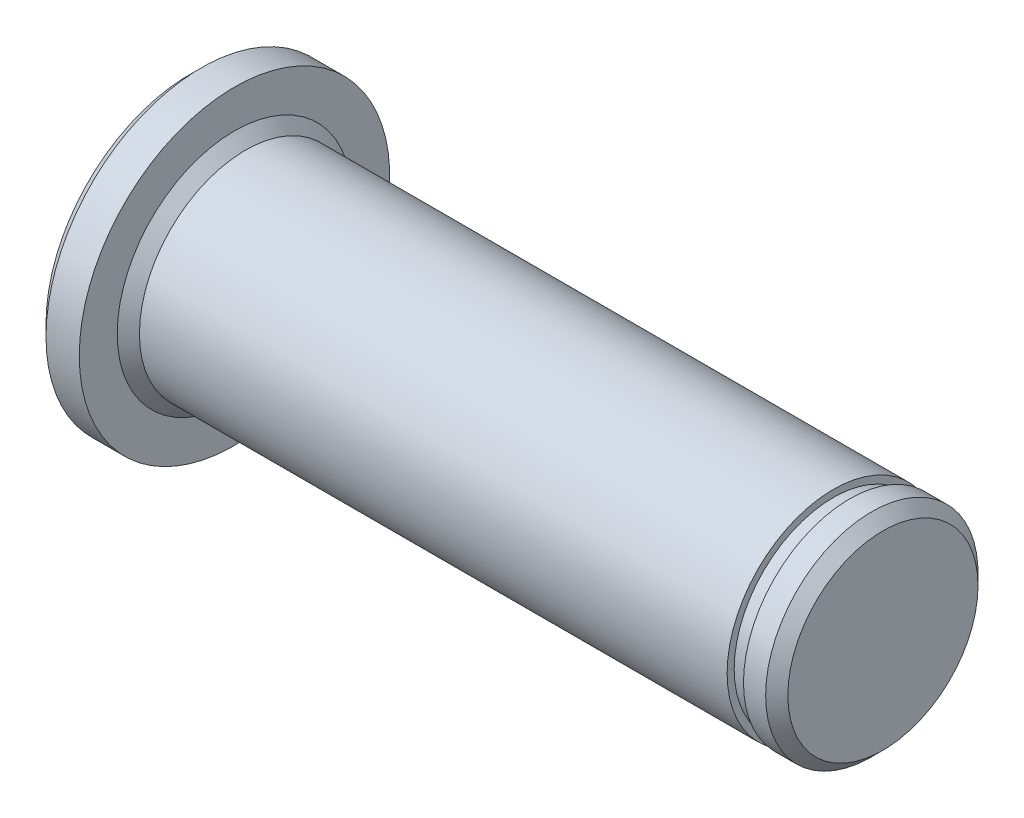
ISO-10303-21;
HEADER;
FILE_DESCRIPTION(('STEP AP214'),'2;1');
FILE_NAME('part.step','',(''),(''),'','','');
FILE_SCHEMA(('AUTOMOTIVE_DESIGN { 1 0 10303 214 1 1 1 1 }'));
ENDSEC;
DATA;
#1=APPLICATION_CONTEXT('core data for automotive mechanical design processes');
#2=APPLICATION_PROTOCOL_DEFINITION('international standard','automotive_design',2000,#1);
#3=PRODUCT_CONTEXT('',#1,'mechanical');
#4=PRODUCT('Part','Part','',(#3));
#5=PRODUCT_RELATED_PRODUCT_CATEGORY('part','',(#4));
#6=PRODUCT_DEFINITION_FORMATION('','',#4);
#7=PRODUCT_DEFINITION_CONTEXT('part definition',#1,'design');
#8=PRODUCT_DEFINITION('design','',#6,#7);
#9=PRODUCT_DEFINITION_SHAPE('','',#8);
#10=(LENGTH_UNIT() NAMED_UNIT(*) SI_UNIT(.MILLI.,.METRE.));
#11=(NAMED_UNIT(*) PLANE_ANGLE_UNIT() SI_UNIT($,.RADIAN.));
#12=(NAMED_UNIT(*) SI_UNIT($,.STERADIAN.) SOLID_ANGLE_UNIT());
#13=UNCERTAINTY_MEASURE_WITH_UNIT(LENGTH_MEASURE(1.E-05),#10,'distance_accuracy_value','');
#14=(GEOMETRIC_REPRESENTATION_CONTEXT(3) GLOBAL_UNCERTAINTY_ASSIGNED_CONTEXT((#13)) GLOBAL_UNIT_ASSIGNED_CONTEXT((#10,
#11,#12)) REPRESENTATION_CONTEXT('',''));
#15=CARTESIAN_POINT('',(0.,0.,0.));
#16=DIRECTION('',(0.,0.,1.));
#17=DIRECTION('',(1.,0.,0.));
#18=AXIS2_PLACEMENT_3D('',#15,#16,#17);
#19=CARTESIAN_POINT('',(-78.5354132953269,0.,0.));
#20=DIRECTION('',(-1.,0.,0.));
#21=DIRECTION('',(0.,0.,1.));
#22=AXIS2_PLACEMENT_3D('',#19,#20,#21);
#23=CYLINDRICAL_SURFACE('',#22,4.7875);
#24=CARTESIAN_POINT('',(0.5,0.,0.));
#25=DIRECTION('',(-1.,0.,0.));
#26=DIRECTION('',(0.,0.,1.));
#27=AXIS2_PLACEMENT_3D('',#24,#25,#26);
#28=CIRCLE('',#27,4.7875);
#29=CARTESIAN_POINT('',(0.5,0.,4.7875));
#30=VERTEX_POINT('',#29);
#31=EDGE_CURVE('E43',#30,#30,#28,.F.);
#32=ORIENTED_EDGE('',*,*,#31,.T.);
#33=EDGE_LOOP('',(#32));
#34=FACE_BOUND('',#33,.T.);
#35=CARTESIAN_POINT('',(27.,0.,0.));
#36=DIRECTION('',(-1.,0.,0.));
#37=DIRECTION('',(0.,0.,1.));
#38=AXIS2_PLACEMENT_3D('',#35,#36,#37);
#39=CIRCLE('',#38,4.7875);
#40=CARTESIAN_POINT('',(27.,0.,4.7875));
#41=VERTEX_POINT('',#40);
#42=EDGE_CURVE('E58',#41,#41,#39,.T.);
#43=ORIENTED_EDGE('',*,*,#42,.T.);
#44=EDGE_LOOP('',(#43));
#45=FACE_BOUND('',#44,.T.);
#46=ADVANCED_FACE('F32',(#34,#45),#23,.T.);
#47=CARTESIAN_POINT('',(27.,4.7875,0.));
#48=DIRECTION('',(-1.,0.,0.));
#49=DIRECTION('',(0.,0.,1.));
#50=AXIS2_PLACEMENT_3D('',#47,#48,#49);
#51=PLANE('',#50);
#52=ORIENTED_EDGE('',*,*,#42,.F.);
#53=EDGE_LOOP('',(#52));
#54=FACE_BOUND('',#53,.T.);
#55=CARTESIAN_POINT('',(27.,0.,0.));
#56=DIRECTION('',(-1.,0.,0.));
#57=DIRECTION('',(0.,0.,1.));
#58=AXIS2_PLACEMENT_3D('',#55,#56,#57);
#59=CIRCLE('',#58,4.47);
#60=CARTESIAN_POINT('',(27.,0.,4.47));
#61=VERTEX_POINT('',#60);
#62=EDGE_CURVE('E61',#61,#61,#59,.T.);
#63=ORIENTED_EDGE('',*,*,#62,.T.);
#64=EDGE_LOOP('',(#63));
#65=FACE_BOUND('',#64,.T.);
#66=ADVANCED_FACE('F92',(#54,#65),#51,.F.);
#67=CARTESIAN_POINT('',(-78.5354132953269,0.,0.));
#68=DIRECTION('',(-1.,0.,0.));
#69=DIRECTION('',(0.,0.,1.));
#70=AXIS2_PLACEMENT_3D('',#67,#68,#69);
#71=CYLINDRICAL_SURFACE('',#70,4.47);
#72=ORIENTED_EDGE('',*,*,#62,.F.);
#73=EDGE_LOOP('',(#72));
#74=FACE_BOUND('',#73,.T.);
#75=CARTESIAN_POINT('',(27.737,0.,0.));
#76=DIRECTION('',(-1.,0.,0.));
#77=DIRECTION('',(0.,0.,1.));
#78=AXIS2_PLACEMENT_3D('',#75,#76,#77);
#79=CIRCLE('',#78,4.47);
#80=CARTESIAN_POINT('',(27.737,0.,4.47));
#81=VERTEX_POINT('',#80);
#82=EDGE_CURVE('E64',#81,#81,#79,.T.);
#83=ORIENTED_EDGE('',*,*,#82,.T.);
#84=EDGE_LOOP('',(#83));
#85=FACE_BOUND('',#84,.T.);
#86=ADVANCED_FACE('F98',(#74,#85),#71,.T.);
#87=CARTESIAN_POINT('',(27.737,4.47,0.));
#88=DIRECTION('',(1.,0.,0.));
#89=DIRECTION('',(0.,0.,-1.));
#90=AXIS2_PLACEMENT_3D('',#87,#88,#89);
#91=PLANE('',#90);
#92=ORIENTED_EDGE('',*,*,#82,.F.);
#93=EDGE_LOOP('',(#92));
#94=FACE_BOUND('',#93,.T.);
#95=CARTESIAN_POINT('',(27.737,0.,0.));
#96=DIRECTION('',(-1.,0.,0.));
#97=DIRECTION('',(0.,0.,1.));
#98=AXIS2_PLACEMENT_3D('',#95,#96,#97);
#99=CIRCLE('',#98,4.7875);
#100=CARTESIAN_POINT('',(27.737,0.,4.7875));
#101=VERTEX_POINT('',#100);
#102=EDGE_CURVE('E67',#101,#101,#99,.T.);
#103=ORIENTED_EDGE('',*,*,#102,.T.);
#104=EDGE_LOOP('',(#103));
#105=FACE_BOUND('',#104,.T.);
#106=ADVANCED_FACE('F162',(#94,#105),#91,.F.);
#107=CARTESIAN_POINT('',(-78.5354132953269,0.,0.));
#108=DIRECTION('',(-1.,0.,0.));
#109=DIRECTION('',(0.,0.,1.));
#110=AXIS2_PLACEMENT_3D('',#107,#108,#109);
#111=CYLINDRICAL_SURFACE('',#110,4.7875);
#112=CARTESIAN_POINT('',(28.737,0.,0.));
#113=DIRECTION('',(-1.,0.,0.));
#114=DIRECTION('',(0.,0.,1.));
#115=AXIS2_PLACEMENT_3D('',#112,#113,#114);
#116=CIRCLE('',#115,4.7875);
#117=CARTESIAN_POINT('',(28.737,0.,4.7875));
#118=VERTEX_POINT('',#117);
#119=EDGE_CURVE('E39',#118,#118,#116,.T.);
#120=ORIENTED_EDGE('',*,*,#119,.T.);
#121=EDGE_LOOP('',(#120));
#122=FACE_BOUND('',#121,.T.);
#123=ORIENTED_EDGE('',*,*,#102,.F.);
#124=EDGE_LOOP('',(#123));
#125=FACE_BOUND('',#124,.T.);
#126=ADVANCED_FACE('F154',(#122,#125),#111,.T.);
#127=CARTESIAN_POINT('',(29.237,4.7875,0.));
#128=DIRECTION('',(-1.,0.,0.));
#129=DIRECTION('',(0.,0.,1.));
#130=AXIS2_PLACEMENT_3D('',#127,#128,#129);
#131=PLANE('',#130);
#132=CARTESIAN_POINT('',(29.237,0.,0.));
#133=DIRECTION('',(-1.,0.,0.));
#134=DIRECTION('',(0.,0.,1.));
#135=AXIS2_PLACEMENT_3D('',#132,#133,#134);
#136=CIRCLE('',#135,4.28749999999999);
#137=CARTESIAN_POINT('',(29.237,0.,4.28749999999999));
#138=VERTEX_POINT('',#137);
#139=EDGE_CURVE('E10',#138,#138,#136,.F.);
#140=ORIENTED_EDGE('',*,*,#139,.T.);
#141=EDGE_LOOP('',(#140));
#142=FACE_BOUND('',#141,.T.);
#143=ADVANCED_FACE('F144',(#142),#131,.F.);
#144=CARTESIAN_POINT('',(-2.,7.,0.));
#145=DIRECTION('',(1.,0.,0.));
#146=DIRECTION('',(0.,0.,-1.));
#147=AXIS2_PLACEMENT_3D('',#144,#145,#146);
#148=PLANE('',#147);
#149=CARTESIAN_POINT('',(-2.,0.,0.));
#150=DIRECTION('',(1.,0.,0.));
#151=DIRECTION('',(0.,0.,-1.));
#152=AXIS2_PLACEMENT_3D('',#149,#150,#151);
#153=CIRCLE('',#152,6.5);
#154=CARTESIAN_POINT('',(-2.,0.,-6.5));
#155=VERTEX_POINT('',#154);
#156=EDGE_CURVE('E55',#155,#155,#153,.F.);
#157=ORIENTED_EDGE('',*,*,#156,.T.);
#158=EDGE_LOOP('',(#157));
#159=FACE_BOUND('',#158,.T.);
#160=ADVANCED_FACE('F88',(#159),#148,.F.);
#161=CARTESIAN_POINT('',(-78.5354132953269,0.,0.));
#162=DIRECTION('',(-1.,0.,0.));
#163=DIRECTION('',(0.,0.,1.));
#164=AXIS2_PLACEMENT_3D('',#161,#162,#163);
#165=CYLINDRICAL_SURFACE('',#164,7.);
#166=CARTESIAN_POINT('',(-1.5,0.,0.));
#167=DIRECTION('',(1.,0.,0.));
#168=DIRECTION('',(0.,0.,-1.));
#169=AXIS2_PLACEMENT_3D('',#166,#167,#168);
#170=CIRCLE('',#169,7.);
#171=CARTESIAN_POINT('',(-1.5,0.,-7.));
#172=VERTEX_POINT('',#171);
#173=EDGE_CURVE('E52',#172,#172,#170,.T.);
#174=ORIENTED_EDGE('',*,*,#173,.T.);
#175=EDGE_LOOP('',(#174));
#176=FACE_BOUND('',#175,.T.);
#177=CARTESIAN_POINT('',(0.,0.,0.));
#178=DIRECTION('',(-1.,0.,0.));
#179=DIRECTION('',(0.,0.,1.));
#180=AXIS2_PLACEMENT_3D('',#177,#178,#179);
#181=CIRCLE('',#180,7.);
#182=CARTESIAN_POINT('',(0.,0.,7.));
#183=VERTEX_POINT('',#182);
#184=EDGE_CURVE('E70',#183,#183,#181,.T.);
#185=ORIENTED_EDGE('',*,*,#184,.T.);
#186=EDGE_LOOP('',(#185));
#187=FACE_BOUND('',#186,.T.);
#188=ADVANCED_FACE('F74',(#176,#187),#165,.T.);
#189=CARTESIAN_POINT('',(0.,4.7875,0.));
#190=DIRECTION('',(-1.,0.,0.));
#191=DIRECTION('',(0.,0.,1.));
#192=AXIS2_PLACEMENT_3D('',#189,#190,#191);
#193=PLANE('',#192);
#194=CARTESIAN_POINT('',(0.,0.,0.));
#195=DIRECTION('',(-1.,0.,0.));
#196=DIRECTION('',(0.,0.,1.));
#197=AXIS2_PLACEMENT_3D('',#194,#195,#196);
#198=CIRCLE('',#197,5.2875);
#199=CARTESIAN_POINT('',(0.,0.,5.2875));
#200=VERTEX_POINT('',#199);
#201=EDGE_CURVE('E47',#200,#200,#198,.T.);
#202=ORIENTED_EDGE('',*,*,#201,.T.);
#203=EDGE_LOOP('',(#202));
#204=FACE_BOUND('',#203,.T.);
#205=ORIENTED_EDGE('',*,*,#184,.F.);
#206=EDGE_LOOP('',(#205));
#207=FACE_BOUND('',#206,.T.);
#208=ADVANCED_FACE('F76',(#204,#207),#193,.F.);
#209=CARTESIAN_POINT('',(-2.,0.,0.));
#210=DIRECTION('',(1.,0.,0.));
#211=DIRECTION('',(0.,0.,-1.));
#212=AXIS2_PLACEMENT_3D('',#209,#210,#211);
#213=CONICAL_SURFACE('',#212,6.5,0.785398163397445);
#214=ORIENTED_EDGE('',*,*,#173,.F.);
#215=EDGE_LOOP('',(#214));
#216=FACE_BOUND('',#215,.T.);
#217=ORIENTED_EDGE('',*,*,#156,.F.);
#218=EDGE_LOOP('',(#217));
#219=FACE_BOUND('',#218,.T.);
#220=ADVANCED_FACE('F78',(#216,#219),#213,.T.);
#221=CARTESIAN_POINT('',(0.,0.,0.));
#222=DIRECTION('',(-1.,0.,0.));
#223=DIRECTION('',(0.,0.,1.));
#224=AXIS2_PLACEMENT_3D('',#221,#222,#223);
#225=CONICAL_SURFACE('',#224,5.2875,0.785398163397446);
#226=ORIENTED_EDGE('',*,*,#31,.F.);
#227=EDGE_LOOP('',(#226));
#228=FACE_BOUND('',#227,.T.);
#229=ORIENTED_EDGE('',*,*,#201,.F.);
#230=EDGE_LOOP('',(#229));
#231=FACE_BOUND('',#230,.T.);
#232=ADVANCED_FACE('F85',(#228,#231),#225,.T.);
#233=CARTESIAN_POINT('',(28.737,0.,0.));
#234=DIRECTION('',(-1.,0.,0.));
#235=DIRECTION('',(0.,0.,1.));
#236=AXIS2_PLACEMENT_3D('',#233,#234,#235);
#237=CONICAL_SURFACE('',#236,4.7875,0.785398163397452);
#238=ORIENTED_EDGE('',*,*,#139,.F.);
#239=EDGE_LOOP('',(#238));
#240=FACE_BOUND('',#239,.T.);
#241=ORIENTED_EDGE('',*,*,#119,.F.);
#242=EDGE_LOOP('',(#241));
#243=FACE_BOUND('',#242,.T.);
#244=ADVANCED_FACE('F34',(#240,#243),#237,.T.);
#245=CLOSED_SHELL('',(#46,#66,#86,#106,#126,#143,#160,#188,#208,#220,#232,#244));
#246=MANIFOLD_SOLID_BREP('B2',#245);
#247=ADVANCED_BREP_SHAPE_REPRESENTATION('',(#18,#246),#14);
#248=SHAPE_DEFINITION_REPRESENTATION(#9,#247);
ENDSEC;
END-ISO-10303-21;
